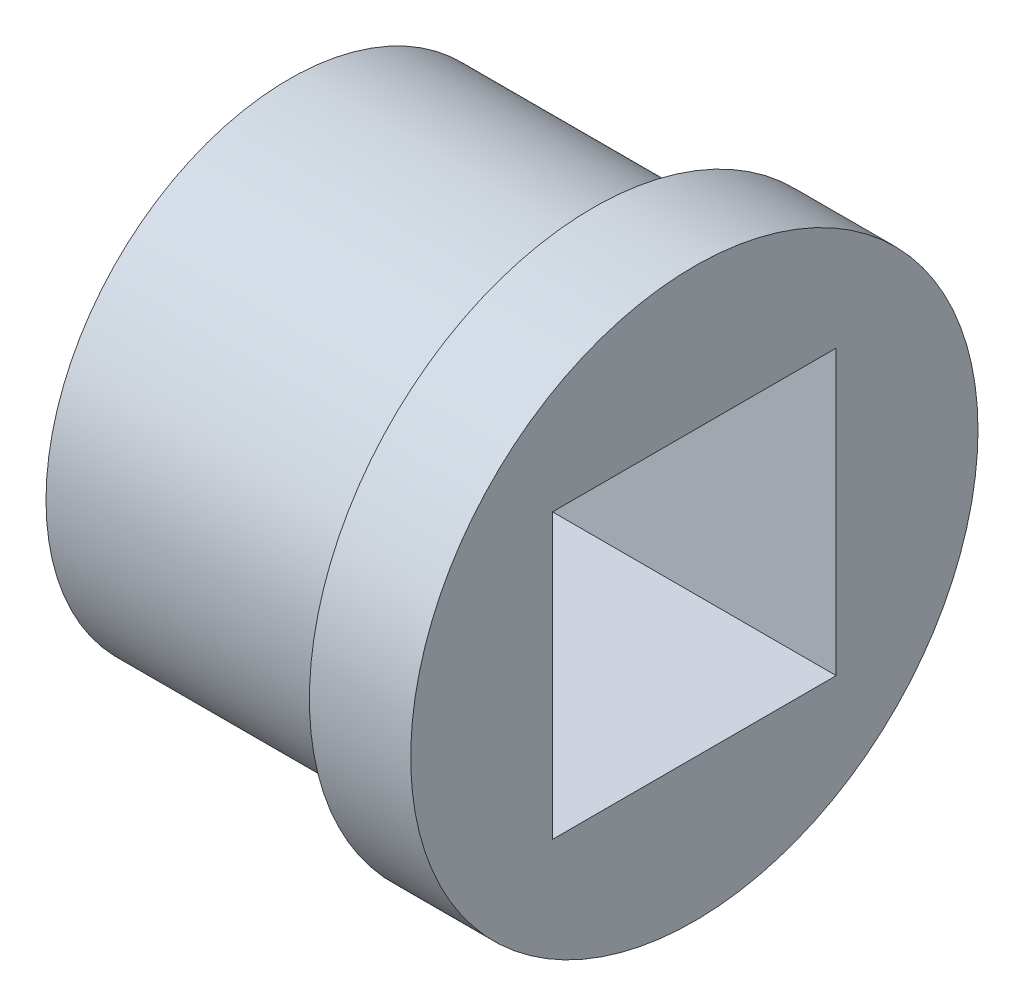
ISO-10303-21;
HEADER;
FILE_DESCRIPTION(('STEP AP214'),'2;1');
FILE_NAME('part.step','',(''),(''),'','','');
FILE_SCHEMA(('AUTOMOTIVE_DESIGN { 1 0 10303 214 1 1 1 1 }'));
ENDSEC;
DATA;
#1=APPLICATION_CONTEXT('core data for automotive mechanical design processes');
#2=APPLICATION_PROTOCOL_DEFINITION('international standard','automotive_design',2000,#1);
#3=PRODUCT_CONTEXT('',#1,'mechanical');
#4=PRODUCT('Part','Part','',(#3));
#5=PRODUCT_RELATED_PRODUCT_CATEGORY('part','',(#4));
#6=PRODUCT_DEFINITION_FORMATION('','',#4);
#7=PRODUCT_DEFINITION_CONTEXT('part definition',#1,'design');
#8=PRODUCT_DEFINITION('design','',#6,#7);
#9=PRODUCT_DEFINITION_SHAPE('','',#8);
#10=(LENGTH_UNIT() NAMED_UNIT(*) SI_UNIT(.MILLI.,.METRE.));
#11=(NAMED_UNIT(*) PLANE_ANGLE_UNIT() SI_UNIT($,.RADIAN.));
#12=(NAMED_UNIT(*) SI_UNIT($,.STERADIAN.) SOLID_ANGLE_UNIT());
#13=UNCERTAINTY_MEASURE_WITH_UNIT(LENGTH_MEASURE(1.E-05),#10,'distance_accuracy_value','');
#14=(GEOMETRIC_REPRESENTATION_CONTEXT(3) GLOBAL_UNCERTAINTY_ASSIGNED_CONTEXT((#13)) GLOBAL_UNIT_ASSIGNED_CONTEXT((#10,
#11,#12)) REPRESENTATION_CONTEXT('',''));
#15=CARTESIAN_POINT('',(0.,0.,0.));
#16=DIRECTION('',(0.,0.,1.));
#17=DIRECTION('',(1.,0.,0.));
#18=AXIS2_PLACEMENT_3D('',#15,#16,#17);
#19=CARTESIAN_POINT('',(3.81,0.,0.));
#20=DIRECTION('',(-1.,0.,0.));
#21=DIRECTION('',(0.,0.,1.));
#22=AXIS2_PLACEMENT_3D('',#19,#20,#21);
#23=CYLINDRICAL_SURFACE('',#22,3.048);
#24=CARTESIAN_POINT('',(3.81,0.,0.));
#25=DIRECTION('',(1.,0.,0.));
#26=DIRECTION('',(0.,0.,-1.));
#27=AXIS2_PLACEMENT_3D('',#24,#25,#26);
#28=CIRCLE('',#27,3.048);
#29=CARTESIAN_POINT('',(3.81,0.,-3.048));
#30=VERTEX_POINT('',#29);
#31=EDGE_CURVE('E11',#30,#30,#28,.T.);
#32=ORIENTED_EDGE('',*,*,#31,.F.);
#33=EDGE_LOOP('',(#32));
#34=FACE_BOUND('',#33,.T.);
#35=CARTESIAN_POINT('',(0.,0.,0.));
#36=DIRECTION('',(1.,0.,0.));
#37=DIRECTION('',(0.,0.,-1.));
#38=AXIS2_PLACEMENT_3D('',#35,#36,#37);
#39=CIRCLE('',#38,3.048);
#40=CARTESIAN_POINT('',(0.,0.,-3.048));
#41=VERTEX_POINT('',#40);
#42=EDGE_CURVE('E38',#41,#41,#39,.T.);
#43=ORIENTED_EDGE('',*,*,#42,.T.);
#44=EDGE_LOOP('',(#43));
#45=FACE_BOUND('',#44,.T.);
#46=ADVANCED_FACE('F35',(#34,#45),#23,.T.);
#47=CARTESIAN_POINT('',(0.,0.,0.));
#48=DIRECTION('',(1.,0.,0.));
#49=DIRECTION('',(0.,0.,-1.));
#50=AXIS2_PLACEMENT_3D('',#47,#48,#49);
#51=PLANE('',#50);
#52=DIRECTION('',(0.,0.,1.));
#53=VECTOR('',#52,1.);
#54=CARTESIAN_POINT('',(0.,-1.778,1.778));
#55=LINE('',#54,#53);
#56=CARTESIAN_POINT('',(0.,-1.778,-1.778));
#57=VERTEX_POINT('',#56);
#58=CARTESIAN_POINT('',(0.,-1.778,1.778));
#59=VERTEX_POINT('',#58);
#60=EDGE_CURVE('E102',#57,#59,#55,.T.);
#61=ORIENTED_EDGE('',*,*,#60,.F.);
#62=DIRECTION('',(0.,-1.,0.));
#63=VECTOR('',#62,1.);
#64=CARTESIAN_POINT('',(0.,1.778,-1.778));
#65=LINE('',#64,#63);
#66=CARTESIAN_POINT('',(0.,1.778,-1.778));
#67=VERTEX_POINT('',#66);
#68=EDGE_CURVE('E49',#67,#57,#65,.T.);
#69=ORIENTED_EDGE('',*,*,#68,.F.);
#70=DIRECTION('',(0.,0.,-1.));
#71=VECTOR('',#70,1.);
#72=CARTESIAN_POINT('',(0.,1.778,1.778));
#73=LINE('',#72,#71);
#74=CARTESIAN_POINT('',(0.,1.778,1.778));
#75=VERTEX_POINT('',#74);
#76=EDGE_CURVE('E93',#75,#67,#73,.T.);
#77=ORIENTED_EDGE('',*,*,#76,.F.);
#78=DIRECTION('',(0.,1.,0.));
#79=VECTOR('',#78,1.);
#80=CARTESIAN_POINT('',(0.,1.778,1.778));
#81=LINE('',#80,#79);
#82=EDGE_CURVE('E96',#59,#75,#81,.T.);
#83=ORIENTED_EDGE('',*,*,#82,.F.);
#84=EDGE_LOOP('',(#61,#69,#77,#83));
#85=FACE_BOUND('',#84,.T.);
#86=ORIENTED_EDGE('',*,*,#42,.F.);
#87=EDGE_LOOP('',(#86));
#88=FACE_BOUND('',#87,.T.);
#89=ADVANCED_FACE('F133',(#85,#88),#51,.F.);
#90=CARTESIAN_POINT('',(5.08,0.,0.));
#91=DIRECTION('',(-1.,0.,0.));
#92=DIRECTION('',(0.,0.,1.));
#93=AXIS2_PLACEMENT_3D('',#90,#91,#92);
#94=CYLINDRICAL_SURFACE('',#93,3.556);
#95=CARTESIAN_POINT('',(5.08,0.,0.));
#96=DIRECTION('',(1.,0.,0.));
#97=DIRECTION('',(0.,0.,-1.));
#98=AXIS2_PLACEMENT_3D('',#95,#96,#97);
#99=CIRCLE('',#98,3.556);
#100=CARTESIAN_POINT('',(5.08,0.,-3.556));
#101=VERTEX_POINT('',#100);
#102=EDGE_CURVE('E112',#101,#101,#99,.T.);
#103=ORIENTED_EDGE('',*,*,#102,.F.);
#104=EDGE_LOOP('',(#103));
#105=FACE_BOUND('',#104,.T.);
#106=CARTESIAN_POINT('',(3.81,0.,0.));
#107=DIRECTION('',(1.,0.,0.));
#108=DIRECTION('',(0.,0.,-1.));
#109=AXIS2_PLACEMENT_3D('',#106,#107,#108);
#110=CIRCLE('',#109,3.556);
#111=CARTESIAN_POINT('',(3.81,0.,-3.556));
#112=VERTEX_POINT('',#111);
#113=EDGE_CURVE('E108',#112,#112,#110,.T.);
#114=ORIENTED_EDGE('',*,*,#113,.T.);
#115=EDGE_LOOP('',(#114));
#116=FACE_BOUND('',#115,.T.);
#117=ADVANCED_FACE('F118',(#105,#116),#94,.T.);
#118=CARTESIAN_POINT('',(5.08,0.,0.));
#119=DIRECTION('',(1.,0.,0.));
#120=DIRECTION('',(0.,0.,-1.));
#121=AXIS2_PLACEMENT_3D('',#118,#119,#120);
#122=PLANE('',#121);
#123=DIRECTION('',(0.,-1.,0.));
#124=VECTOR('',#123,1.);
#125=CARTESIAN_POINT('',(5.08,1.778,-1.778));
#126=LINE('',#125,#124);
#127=CARTESIAN_POINT('',(5.08,1.778,-1.778));
#128=VERTEX_POINT('',#127);
#129=CARTESIAN_POINT('',(5.08,-1.778,-1.778));
#130=VERTEX_POINT('',#129);
#131=EDGE_CURVE('E77',#128,#130,#126,.T.);
#132=ORIENTED_EDGE('',*,*,#131,.T.);
#133=DIRECTION('',(0.,0.,1.));
#134=VECTOR('',#133,1.);
#135=CARTESIAN_POINT('',(5.08,-1.778,1.778));
#136=LINE('',#135,#134);
#137=CARTESIAN_POINT('',(5.08,-1.778,1.778));
#138=VERTEX_POINT('',#137);
#139=EDGE_CURVE('E86',#130,#138,#136,.T.);
#140=ORIENTED_EDGE('',*,*,#139,.T.);
#141=DIRECTION('',(0.,1.,0.));
#142=VECTOR('',#141,1.);
#143=CARTESIAN_POINT('',(5.08,1.778,1.778));
#144=LINE('',#143,#142);
#145=CARTESIAN_POINT('',(5.08,1.778,1.778));
#146=VERTEX_POINT('',#145);
#147=EDGE_CURVE('E57',#138,#146,#144,.T.);
#148=ORIENTED_EDGE('',*,*,#147,.T.);
#149=DIRECTION('',(0.,0.,-1.));
#150=VECTOR('',#149,1.);
#151=CARTESIAN_POINT('',(5.08,1.778,1.778));
#152=LINE('',#151,#150);
#153=EDGE_CURVE('E83',#146,#128,#152,.T.);
#154=ORIENTED_EDGE('',*,*,#153,.T.);
#155=EDGE_LOOP('',(#132,#140,#148,#154));
#156=FACE_BOUND('',#155,.T.);
#157=ORIENTED_EDGE('',*,*,#102,.T.);
#158=EDGE_LOOP('',(#157));
#159=FACE_BOUND('',#158,.T.);
#160=ADVANCED_FACE('F90',(#156,#159),#122,.T.);
#161=CARTESIAN_POINT('',(3.81,0.,0.));
#162=DIRECTION('',(1.,0.,0.));
#163=DIRECTION('',(0.,0.,-1.));
#164=AXIS2_PLACEMENT_3D('',#161,#162,#163);
#165=PLANE('',#164);
#166=ORIENTED_EDGE('',*,*,#31,.T.);
#167=EDGE_LOOP('',(#166));
#168=FACE_BOUND('',#167,.T.);
#169=ORIENTED_EDGE('',*,*,#113,.F.);
#170=EDGE_LOOP('',(#169));
#171=FACE_BOUND('',#170,.T.);
#172=ADVANCED_FACE('F120',(#168,#171),#165,.F.);
#173=CARTESIAN_POINT('',(5.08,1.778,-1.778));
#174=DIRECTION('',(0.,0.,-1.));
#175=DIRECTION('',(0.,1.,0.));
#176=AXIS2_PLACEMENT_3D('',#173,#174,#175);
#177=PLANE('',#176);
#178=ORIENTED_EDGE('',*,*,#68,.T.);
#179=DIRECTION('',(-1.,0.,0.));
#180=VECTOR('',#179,1.);
#181=CARTESIAN_POINT('',(5.08,-1.778,-1.778));
#182=LINE('',#181,#180);
#183=EDGE_CURVE('E73',#130,#57,#182,.T.);
#184=ORIENTED_EDGE('',*,*,#183,.F.);
#185=ORIENTED_EDGE('',*,*,#131,.F.);
#186=DIRECTION('',(-1.,0.,0.));
#187=VECTOR('',#186,1.);
#188=CARTESIAN_POINT('',(5.08,1.778,-1.778));
#189=LINE('',#188,#187);
#190=EDGE_CURVE('E106',#128,#67,#189,.T.);
#191=ORIENTED_EDGE('',*,*,#190,.T.);
#192=EDGE_LOOP('',(#178,#184,#185,#191));
#193=FACE_BOUND('',#192,.T.);
#194=ADVANCED_FACE('F75',(#193),#177,.F.);
#195=CARTESIAN_POINT('',(5.08,1.778,1.778));
#196=DIRECTION('',(0.,1.,0.));
#197=DIRECTION('',(0.,0.,1.));
#198=AXIS2_PLACEMENT_3D('',#195,#196,#197);
#199=PLANE('',#198);
#200=ORIENTED_EDGE('',*,*,#76,.T.);
#201=ORIENTED_EDGE('',*,*,#190,.F.);
#202=ORIENTED_EDGE('',*,*,#153,.F.);
#203=DIRECTION('',(-1.,0.,0.));
#204=VECTOR('',#203,1.);
#205=CARTESIAN_POINT('',(5.08,1.778,1.778));
#206=LINE('',#205,#204);
#207=EDGE_CURVE('E109',#146,#75,#206,.T.);
#208=ORIENTED_EDGE('',*,*,#207,.T.);
#209=EDGE_LOOP('',(#200,#201,#202,#208));
#210=FACE_BOUND('',#209,.T.);
#211=ADVANCED_FACE('F128',(#210),#199,.F.);
#212=CARTESIAN_POINT('',(5.08,1.778,1.778));
#213=DIRECTION('',(0.,0.,1.));
#214=DIRECTION('',(0.,-1.,0.));
#215=AXIS2_PLACEMENT_3D('',#212,#213,#214);
#216=PLANE('',#215);
#217=ORIENTED_EDGE('',*,*,#82,.T.);
#218=ORIENTED_EDGE('',*,*,#207,.F.);
#219=ORIENTED_EDGE('',*,*,#147,.F.);
#220=DIRECTION('',(-1.,0.,0.));
#221=VECTOR('',#220,1.);
#222=CARTESIAN_POINT('',(5.08,-1.778,1.778));
#223=LINE('',#222,#221);
#224=EDGE_CURVE('E82',#138,#59,#223,.T.);
#225=ORIENTED_EDGE('',*,*,#224,.T.);
#226=EDGE_LOOP('',(#217,#218,#219,#225));
#227=FACE_BOUND('',#226,.T.);
#228=ADVANCED_FACE('F150',(#227),#216,.F.);
#229=CARTESIAN_POINT('',(5.08,-1.778,1.778));
#230=DIRECTION('',(0.,-1.,0.));
#231=DIRECTION('',(0.,0.,-1.));
#232=AXIS2_PLACEMENT_3D('',#229,#230,#231);
#233=PLANE('',#232);
#234=ORIENTED_EDGE('',*,*,#60,.T.);
#235=ORIENTED_EDGE('',*,*,#224,.F.);
#236=ORIENTED_EDGE('',*,*,#139,.F.);
#237=ORIENTED_EDGE('',*,*,#183,.T.);
#238=EDGE_LOOP('',(#234,#235,#236,#237));
#239=FACE_BOUND('',#238,.T.);
#240=ADVANCED_FACE('F87',(#239),#233,.F.);
#241=CLOSED_SHELL('',(#46,#89,#117,#160,#172,#194,#211,#228,#240));
#242=MANIFOLD_SOLID_BREP('B2',#241);
#243=ADVANCED_BREP_SHAPE_REPRESENTATION('',(#18,#242),#14);
#244=SHAPE_DEFINITION_REPRESENTATION(#9,#243);
ENDSEC;
END-ISO-10303-21;
